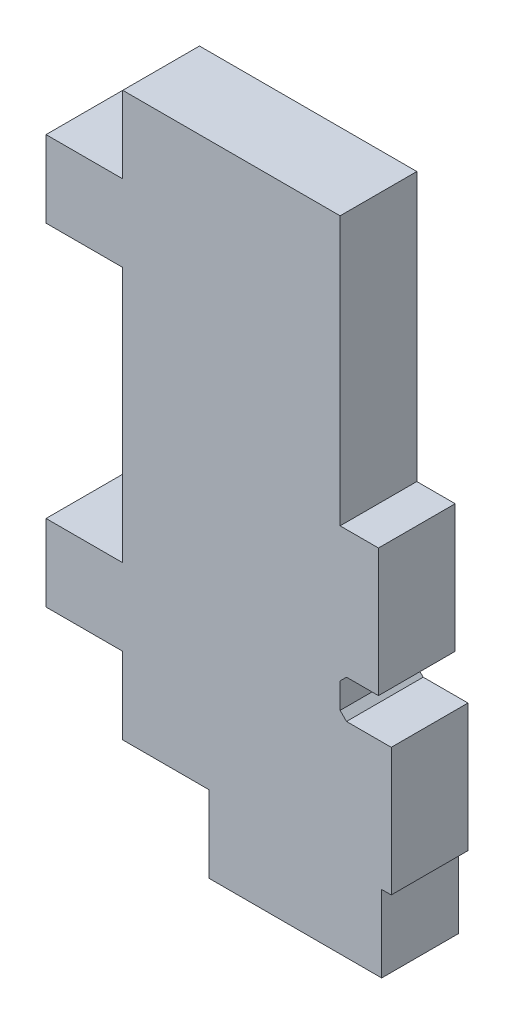
ISO-10303-21;
HEADER;
FILE_DESCRIPTION(('STEP AP214'),'2;1');
FILE_NAME('part.step','',(''),(''),'','','');
FILE_SCHEMA(('AUTOMOTIVE_DESIGN { 1 0 10303 214 1 1 1 1 }'));
ENDSEC;
DATA;
#1=APPLICATION_CONTEXT('core data for automotive mechanical design processes');
#2=APPLICATION_PROTOCOL_DEFINITION('international standard','automotive_design',2000,#1);
#3=PRODUCT_CONTEXT('',#1,'mechanical');
#4=PRODUCT('Part','Part','',(#3));
#5=PRODUCT_RELATED_PRODUCT_CATEGORY('part','',(#4));
#6=PRODUCT_DEFINITION_FORMATION('','',#4);
#7=PRODUCT_DEFINITION_CONTEXT('part definition',#1,'design');
#8=PRODUCT_DEFINITION('design','',#6,#7);
#9=PRODUCT_DEFINITION_SHAPE('','',#8);
#10=(LENGTH_UNIT() NAMED_UNIT(*) SI_UNIT(.MILLI.,.METRE.));
#11=(NAMED_UNIT(*) PLANE_ANGLE_UNIT() SI_UNIT($,.RADIAN.));
#12=(NAMED_UNIT(*) SI_UNIT($,.STERADIAN.) SOLID_ANGLE_UNIT());
#13=UNCERTAINTY_MEASURE_WITH_UNIT(LENGTH_MEASURE(1.E-05),#10,'distance_accuracy_value','');
#14=(GEOMETRIC_REPRESENTATION_CONTEXT(3) GLOBAL_UNCERTAINTY_ASSIGNED_CONTEXT((#13)) GLOBAL_UNIT_ASSIGNED_CONTEXT((#10,
#11,#12)) REPRESENTATION_CONTEXT('',''));
#15=CARTESIAN_POINT('',(0.,0.,0.));
#16=DIRECTION('',(0.,0.,1.));
#17=DIRECTION('',(1.,0.,0.));
#18=AXIS2_PLACEMENT_3D('',#15,#16,#17);
#19=CARTESIAN_POINT('',(0.,0.,3.));
#20=DIRECTION('',(0.,0.,1.));
#21=DIRECTION('',(1.,0.,0.));
#22=AXIS2_PLACEMENT_3D('',#19,#20,#21);
#23=PLANE('',#22);
#24=DIRECTION('',(-1.,0.,0.));
#25=VECTOR('',#24,1.);
#26=CARTESIAN_POINT('',(6.75,-4.5,3.));
#27=LINE('',#26,#25);
#28=CARTESIAN_POINT('',(6.25,-4.5,3.));
#29=VERTEX_POINT('',#28);
#30=CARTESIAN_POINT('',(5.,-4.5,3.));
#31=VERTEX_POINT('',#30);
#32=EDGE_CURVE('E204',#29,#31,#27,.T.);
#33=ORIENTED_EDGE('',*,*,#32,.F.);
#34=DIRECTION('',(0.,-1.,0.));
#35=VECTOR('',#34,1.);
#36=CARTESIAN_POINT('',(6.25,0.500000000000002,3.));
#37=LINE('',#36,#35);
#38=CARTESIAN_POINT('',(6.25,0.500000000000002,3.));
#39=VERTEX_POINT('',#38);
#40=EDGE_CURVE('E191',#39,#29,#37,.T.);
#41=ORIENTED_EDGE('',*,*,#40,.F.);
#42=DIRECTION('',(1.,0.,0.));
#43=VECTOR('',#42,1.);
#44=CARTESIAN_POINT('',(6.75,0.500000000000002,3.));
#45=LINE('',#44,#43);
#46=CARTESIAN_POINT('',(4.75,0.500000000000001,3.));
#47=VERTEX_POINT('',#46);
#48=EDGE_CURVE('E445',#47,#39,#45,.T.);
#49=ORIENTED_EDGE('',*,*,#48,.F.);
#50=DIRECTION('',(0.,-1.,0.));
#51=VECTOR('',#50,1.);
#52=CARTESIAN_POINT('',(4.75,11.,3.));
#53=LINE('',#52,#51);
#54=CARTESIAN_POINT('',(4.75,11.,3.));
#55=VERTEX_POINT('',#54);
#56=EDGE_CURVE('E434',#55,#47,#53,.T.);
#57=ORIENTED_EDGE('',*,*,#56,.F.);
#58=DIRECTION('',(-1.,0.,0.));
#59=VECTOR('',#58,1.);
#60=CARTESIAN_POINT('',(-3.75,11.,3.));
#61=LINE('',#60,#59);
#62=CARTESIAN_POINT('',(-3.75,11.,3.));
#63=VERTEX_POINT('',#62);
#64=EDGE_CURVE('E310',#55,#63,#61,.T.);
#65=ORIENTED_EDGE('',*,*,#64,.T.);
#66=DIRECTION('',(0.,-1.,0.));
#67=VECTOR('',#66,1.);
#68=CARTESIAN_POINT('',(-3.75,11.,3.));
#69=LINE('',#68,#67);
#70=CARTESIAN_POINT('',(-3.75,8.,3.));
#71=VERTEX_POINT('',#70);
#72=EDGE_CURVE('E314',#63,#71,#69,.T.);
#73=ORIENTED_EDGE('',*,*,#72,.T.);
#74=DIRECTION('',(1.,0.,0.));
#75=VECTOR('',#74,1.);
#76=CARTESIAN_POINT('',(-6.75,8.,3.));
#77=LINE('',#76,#75);
#78=CARTESIAN_POINT('',(-6.75,8.,3.));
#79=VERTEX_POINT('',#78);
#80=EDGE_CURVE('E243',#79,#71,#77,.T.);
#81=ORIENTED_EDGE('',*,*,#80,.F.);
#82=DIRECTION('',(0.,1.,0.));
#83=VECTOR('',#82,1.);
#84=CARTESIAN_POINT('',(-6.75,8.,3.));
#85=LINE('',#84,#83);
#86=CARTESIAN_POINT('',(-6.75,5.,3.));
#87=VERTEX_POINT('',#86);
#88=EDGE_CURVE('E232',#87,#79,#85,.T.);
#89=ORIENTED_EDGE('',*,*,#88,.F.);
#90=DIRECTION('',(1.,0.,0.));
#91=VECTOR('',#90,1.);
#92=CARTESIAN_POINT('',(-6.75,5.,3.));
#93=LINE('',#92,#91);
#94=CARTESIAN_POINT('',(-3.75,5.,3.));
#95=VERTEX_POINT('',#94);
#96=EDGE_CURVE('E246',#87,#95,#93,.T.);
#97=ORIENTED_EDGE('',*,*,#96,.T.);
#98=CARTESIAN_POINT('',(-3.75,-5.,3.));
#99=VERTEX_POINT('',#98);
#100=EDGE_CURVE('E318',#95,#99,#69,.T.);
#101=ORIENTED_EDGE('',*,*,#100,.T.);
#102=DIRECTION('',(1.,0.,0.));
#103=VECTOR('',#102,1.);
#104=CARTESIAN_POINT('',(-6.75,-5.,3.));
#105=LINE('',#104,#103);
#106=CARTESIAN_POINT('',(-6.75,-5.,3.));
#107=VERTEX_POINT('',#106);
#108=EDGE_CURVE('E270',#107,#99,#105,.T.);
#109=ORIENTED_EDGE('',*,*,#108,.F.);
#110=DIRECTION('',(0.,1.,0.));
#111=VECTOR('',#110,1.);
#112=CARTESIAN_POINT('',(-6.75,-8.,3.));
#113=LINE('',#112,#111);
#114=CARTESIAN_POINT('',(-6.75,-8.,3.));
#115=VERTEX_POINT('',#114);
#116=EDGE_CURVE('E259',#115,#107,#113,.T.);
#117=ORIENTED_EDGE('',*,*,#116,.F.);
#118=DIRECTION('',(1.,0.,0.));
#119=VECTOR('',#118,1.);
#120=CARTESIAN_POINT('',(-6.75,-8.,3.));
#121=LINE('',#120,#119);
#122=CARTESIAN_POINT('',(-3.75,-8.,3.));
#123=VERTEX_POINT('',#122);
#124=EDGE_CURVE('E273',#115,#123,#121,.T.);
#125=ORIENTED_EDGE('',*,*,#124,.T.);
#126=CARTESIAN_POINT('',(-3.75,-11.,3.));
#127=VERTEX_POINT('',#126);
#128=EDGE_CURVE('E313',#123,#127,#69,.T.);
#129=ORIENTED_EDGE('',*,*,#128,.T.);
#130=DIRECTION('',(1.,0.,0.));
#131=VECTOR('',#130,1.);
#132=CARTESIAN_POINT('',(-3.75,-11.,3.));
#133=LINE('',#132,#131);
#134=CARTESIAN_POINT('',(-0.375000000000001,-11.,3.));
#135=VERTEX_POINT('',#134);
#136=EDGE_CURVE('E319',#127,#135,#133,.T.);
#137=ORIENTED_EDGE('',*,*,#136,.T.);
#138=DIRECTION('',(0.,1.,0.));
#139=VECTOR('',#138,1.);
#140=CARTESIAN_POINT('',(-0.375000000000002,-14.,3.));
#141=LINE('',#140,#139);
#142=CARTESIAN_POINT('',(-0.375000000000002,-14.,3.));
#143=VERTEX_POINT('',#142);
#144=EDGE_CURVE('E290',#143,#135,#141,.T.);
#145=ORIENTED_EDGE('',*,*,#144,.F.);
#146=DIRECTION('',(-1.,0.,0.));
#147=VECTOR('',#146,1.);
#148=CARTESIAN_POINT('',(-0.375000000000002,-14.,3.));
#149=LINE('',#148,#147);
#150=CARTESIAN_POINT('',(6.375,-14.,3.));
#151=VERTEX_POINT('',#150);
#152=EDGE_CURVE('E288',#151,#143,#149,.T.);
#153=ORIENTED_EDGE('',*,*,#152,.F.);
#154=DIRECTION('',(0.,1.,0.));
#155=VECTOR('',#154,1.);
#156=CARTESIAN_POINT('',(6.375,-14.,3.));
#157=LINE('',#156,#155);
#158=CARTESIAN_POINT('',(6.375,-11.,3.));
#159=VERTEX_POINT('',#158);
#160=EDGE_CURVE('E297',#151,#159,#157,.T.);
#161=ORIENTED_EDGE('',*,*,#160,.T.);
#162=CARTESIAN_POINT('',(6.75,-11.,3.));
#163=VERTEX_POINT('',#162);
#164=EDGE_CURVE('E317',#159,#163,#133,.T.);
#165=ORIENTED_EDGE('',*,*,#164,.T.);
#166=DIRECTION('',(0.,1.,0.));
#167=VECTOR('',#166,1.);
#168=CARTESIAN_POINT('',(6.75,11.,3.));
#169=LINE('',#168,#167);
#170=CARTESIAN_POINT('',(6.75,-6.,3.));
#171=VERTEX_POINT('',#170);
#172=EDGE_CURVE('E307',#163,#171,#169,.T.);
#173=ORIENTED_EDGE('',*,*,#172,.T.);
#174=DIRECTION('',(1.,0.,0.));
#175=VECTOR('',#174,1.);
#176=CARTESIAN_POINT('',(6.75,-6.,3.));
#177=LINE('',#176,#175);
#178=CARTESIAN_POINT('',(5.,-6.,3.));
#179=VERTEX_POINT('',#178);
#180=EDGE_CURVE('E213',#179,#171,#177,.T.);
#181=ORIENTED_EDGE('',*,*,#180,.F.);
#182=DIRECTION('',(0.707106781186548,-0.707106781186548,0.));
#183=VECTOR('',#182,1.);
#184=CARTESIAN_POINT('',(5.,-6.,3.));
#185=LINE('',#184,#183);
#186=CARTESIAN_POINT('',(4.75,-5.75,3.));
#187=VERTEX_POINT('',#186);
#188=EDGE_CURVE('E41',#179,#187,#185,.F.);
#189=ORIENTED_EDGE('',*,*,#188,.T.);
#190=DIRECTION('',(0.,-1.,0.));
#191=VECTOR('',#190,1.);
#192=CARTESIAN_POINT('',(4.75,-4.5,3.));
#193=LINE('',#192,#191);
#194=CARTESIAN_POINT('',(4.75,-4.75,3.));
#195=VERTEX_POINT('',#194);
#196=EDGE_CURVE('E210',#195,#187,#193,.T.);
#197=ORIENTED_EDGE('',*,*,#196,.F.);
#198=DIRECTION('',(-0.707106781186548,-0.707106781186548,0.));
#199=VECTOR('',#198,1.);
#200=CARTESIAN_POINT('',(4.75,-4.75,3.));
#201=LINE('',#200,#199);
#202=EDGE_CURVE('E208',#195,#31,#201,.F.);
#203=ORIENTED_EDGE('',*,*,#202,.T.);
#204=EDGE_LOOP('',(#33,#41,#49,#57,#65,#73,#81,#89,#97,#101,#109,#117,#125,#129,#137,#145,#153,
#161,#165,#173,#181,#189,#197,#203));
#205=FACE_BOUND('',#204,.T.);
#206=ADVANCED_FACE('F33',(#205),#23,.T.);
#207=CARTESIAN_POINT('',(0.,0.,0.));
#208=DIRECTION('',(0.,0.,1.));
#209=DIRECTION('',(1.,0.,0.));
#210=AXIS2_PLACEMENT_3D('',#207,#208,#209);
#211=PLANE('',#210);
#212=DIRECTION('',(0.,1.,0.));
#213=VECTOR('',#212,1.);
#214=CARTESIAN_POINT('',(6.25,0.500000000000002,0.));
#215=LINE('',#214,#213);
#216=CARTESIAN_POINT('',(6.25,-4.5,0.));
#217=VERTEX_POINT('',#216);
#218=CARTESIAN_POINT('',(6.25,0.500000000000002,0.));
#219=VERTEX_POINT('',#218);
#220=EDGE_CURVE('E48',#217,#219,#215,.T.);
#221=ORIENTED_EDGE('',*,*,#220,.F.);
#222=DIRECTION('',(-1.,0.,0.));
#223=VECTOR('',#222,1.);
#224=CARTESIAN_POINT('',(6.75,-4.5,0.));
#225=LINE('',#224,#223);
#226=CARTESIAN_POINT('',(5.,-4.5,0.));
#227=VERTEX_POINT('',#226);
#228=EDGE_CURVE('E206',#217,#227,#225,.T.);
#229=ORIENTED_EDGE('',*,*,#228,.T.);
#230=DIRECTION('',(0.707106781186548,0.707106781186548,0.));
#231=VECTOR('',#230,1.);
#232=CARTESIAN_POINT('',(4.75,-4.75,0.));
#233=LINE('',#232,#231);
#234=CARTESIAN_POINT('',(4.75,-4.75,0.));
#235=VERTEX_POINT('',#234);
#236=EDGE_CURVE('E347',#227,#235,#233,.F.);
#237=ORIENTED_EDGE('',*,*,#236,.T.);
#238=DIRECTION('',(0.,-1.,0.));
#239=VECTOR('',#238,1.);
#240=CARTESIAN_POINT('',(4.75,-4.5,0.));
#241=LINE('',#240,#239);
#242=CARTESIAN_POINT('',(4.75,-5.75,0.));
#243=VERTEX_POINT('',#242);
#244=EDGE_CURVE('E358',#235,#243,#241,.T.);
#245=ORIENTED_EDGE('',*,*,#244,.T.);
#246=DIRECTION('',(-0.707106781186548,0.707106781186548,0.));
#247=VECTOR('',#246,1.);
#248=CARTESIAN_POINT('',(-0.499999999999999,-0.499999999999999,0.));
#249=LINE('',#248,#247);
#250=CARTESIAN_POINT('',(5.,-6.,0.));
#251=VERTEX_POINT('',#250);
#252=EDGE_CURVE('E11',#243,#251,#249,.F.);
#253=ORIENTED_EDGE('',*,*,#252,.T.);
#254=DIRECTION('',(1.,0.,0.));
#255=VECTOR('',#254,1.);
#256=CARTESIAN_POINT('',(6.75,-6.,0.));
#257=LINE('',#256,#255);
#258=CARTESIAN_POINT('',(6.75,-6.,0.));
#259=VERTEX_POINT('',#258);
#260=EDGE_CURVE('E218',#251,#259,#257,.T.);
#261=ORIENTED_EDGE('',*,*,#260,.T.);
#262=DIRECTION('',(0.,1.,0.));
#263=VECTOR('',#262,1.);
#264=CARTESIAN_POINT('',(6.75,11.,0.));
#265=LINE('',#264,#263);
#266=CARTESIAN_POINT('',(6.75,-11.,0.));
#267=VERTEX_POINT('',#266);
#268=EDGE_CURVE('E306',#267,#259,#265,.T.);
#269=ORIENTED_EDGE('',*,*,#268,.F.);
#270=DIRECTION('',(1.,0.,0.));
#271=VECTOR('',#270,1.);
#272=CARTESIAN_POINT('',(-3.75,-11.,0.));
#273=LINE('',#272,#271);
#274=CARTESIAN_POINT('',(6.375,-11.,0.));
#275=VERTEX_POINT('',#274);
#276=EDGE_CURVE('E330',#275,#267,#273,.T.);
#277=ORIENTED_EDGE('',*,*,#276,.F.);
#278=DIRECTION('',(0.,1.,0.));
#279=VECTOR('',#278,1.);
#280=CARTESIAN_POINT('',(6.375,-14.,0.));
#281=LINE('',#280,#279);
#282=CARTESIAN_POINT('',(6.375,-14.,0.));
#283=VERTEX_POINT('',#282);
#284=EDGE_CURVE('E300',#283,#275,#281,.T.);
#285=ORIENTED_EDGE('',*,*,#284,.F.);
#286=DIRECTION('',(1.,0.,0.));
#287=VECTOR('',#286,1.);
#288=CARTESIAN_POINT('',(-0.375000000000001,-14.,0.));
#289=LINE('',#288,#287);
#290=CARTESIAN_POINT('',(-0.375000000000001,-14.,0.));
#291=VERTEX_POINT('',#290);
#292=EDGE_CURVE('E283',#291,#283,#289,.T.);
#293=ORIENTED_EDGE('',*,*,#292,.F.);
#294=DIRECTION('',(0.,1.,0.));
#295=VECTOR('',#294,1.);
#296=CARTESIAN_POINT('',(-0.375000000000001,-14.,0.));
#297=LINE('',#296,#295);
#298=CARTESIAN_POINT('',(-0.375000000000001,-11.,0.));
#299=VERTEX_POINT('',#298);
#300=EDGE_CURVE('E303',#291,#299,#297,.T.);
#301=ORIENTED_EDGE('',*,*,#300,.T.);
#302=CARTESIAN_POINT('',(-3.75,-11.,0.));
#303=VERTEX_POINT('',#302);
#304=EDGE_CURVE('E311',#303,#299,#273,.T.);
#305=ORIENTED_EDGE('',*,*,#304,.F.);
#306=DIRECTION('',(0.,-1.,0.));
#307=VECTOR('',#306,1.);
#308=CARTESIAN_POINT('',(-3.75,11.,0.));
#309=LINE('',#308,#307);
#310=CARTESIAN_POINT('',(-3.75,-7.99999999999999,0.));
#311=VERTEX_POINT('',#310);
#312=EDGE_CURVE('E327',#311,#303,#309,.T.);
#313=ORIENTED_EDGE('',*,*,#312,.F.);
#314=DIRECTION('',(1.,0.,0.));
#315=VECTOR('',#314,1.);
#316=CARTESIAN_POINT('',(-6.75,-7.99999999999999,0.));
#317=LINE('',#316,#315);
#318=CARTESIAN_POINT('',(-6.75,-7.99999999999999,0.));
#319=VERTEX_POINT('',#318);
#320=EDGE_CURVE('E276',#319,#311,#317,.T.);
#321=ORIENTED_EDGE('',*,*,#320,.F.);
#322=DIRECTION('',(0.,-1.,0.));
#323=VECTOR('',#322,1.);
#324=CARTESIAN_POINT('',(-6.75,-7.99999999999999,0.));
#325=LINE('',#324,#323);
#326=CARTESIAN_POINT('',(-6.75,-5.,0.));
#327=VERTEX_POINT('',#326);
#328=EDGE_CURVE('E253',#327,#319,#325,.T.);
#329=ORIENTED_EDGE('',*,*,#328,.F.);
#330=DIRECTION('',(1.,0.,0.));
#331=VECTOR('',#330,1.);
#332=CARTESIAN_POINT('',(-6.75,-5.,0.));
#333=LINE('',#332,#331);
#334=CARTESIAN_POINT('',(-3.75,-5.,0.));
#335=VERTEX_POINT('',#334);
#336=EDGE_CURVE('E263',#327,#335,#333,.T.);
#337=ORIENTED_EDGE('',*,*,#336,.T.);
#338=CARTESIAN_POINT('',(-3.75,5.,0.));
#339=VERTEX_POINT('',#338);
#340=EDGE_CURVE('E331',#339,#335,#309,.T.);
#341=ORIENTED_EDGE('',*,*,#340,.F.);
#342=DIRECTION('',(1.,0.,0.));
#343=VECTOR('',#342,1.);
#344=CARTESIAN_POINT('',(-6.75,5.,0.));
#345=LINE('',#344,#343);
#346=CARTESIAN_POINT('',(-6.75,5.,0.));
#347=VERTEX_POINT('',#346);
#348=EDGE_CURVE('E249',#347,#339,#345,.T.);
#349=ORIENTED_EDGE('',*,*,#348,.F.);
#350=DIRECTION('',(0.,-1.,0.));
#351=VECTOR('',#350,1.);
#352=CARTESIAN_POINT('',(-6.75,8.,0.));
#353=LINE('',#352,#351);
#354=CARTESIAN_POINT('',(-6.75,8.,0.));
#355=VERTEX_POINT('',#354);
#356=EDGE_CURVE('E226',#355,#347,#353,.T.);
#357=ORIENTED_EDGE('',*,*,#356,.F.);
#358=DIRECTION('',(1.,0.,0.));
#359=VECTOR('',#358,1.);
#360=CARTESIAN_POINT('',(-6.75,8.,0.));
#361=LINE('',#360,#359);
#362=CARTESIAN_POINT('',(-3.75,8.,0.));
#363=VERTEX_POINT('',#362);
#364=EDGE_CURVE('E236',#355,#363,#361,.T.);
#365=ORIENTED_EDGE('',*,*,#364,.T.);
#366=CARTESIAN_POINT('',(-3.75,11.,0.));
#367=VERTEX_POINT('',#366);
#368=EDGE_CURVE('E328',#367,#363,#309,.T.);
#369=ORIENTED_EDGE('',*,*,#368,.F.);
#370=DIRECTION('',(-1.,0.,0.));
#371=VECTOR('',#370,1.);
#372=CARTESIAN_POINT('',(-3.75,11.,0.));
#373=LINE('',#372,#371);
#374=CARTESIAN_POINT('',(4.75,11.,0.));
#375=VERTEX_POINT('',#374);
#376=EDGE_CURVE('E325',#375,#367,#373,.T.);
#377=ORIENTED_EDGE('',*,*,#376,.F.);
#378=DIRECTION('',(0.,-1.,0.));
#379=VECTOR('',#378,1.);
#380=CARTESIAN_POINT('',(4.75,11.,0.));
#381=LINE('',#380,#379);
#382=CARTESIAN_POINT('',(4.75,0.500000000000001,0.));
#383=VERTEX_POINT('',#382);
#384=EDGE_CURVE('E441',#375,#383,#381,.T.);
#385=ORIENTED_EDGE('',*,*,#384,.T.);
#386=DIRECTION('',(1.,0.,0.));
#387=VECTOR('',#386,1.);
#388=CARTESIAN_POINT('',(6.75,0.500000000000002,0.));
#389=LINE('',#388,#387);
#390=EDGE_CURVE('E442',#383,#219,#389,.T.);
#391=ORIENTED_EDGE('',*,*,#390,.T.);
#392=EDGE_LOOP('',(#221,#229,#237,#245,#253,#261,#269,#277,#285,#293,#301,#305,#313,#321,#329,
#337,#341,#349,#357,#365,#369,#377,#385,#391));
#393=FACE_BOUND('',#392,.T.);
#394=ADVANCED_FACE('F363',(#393),#211,.F.);
#395=CARTESIAN_POINT('',(6.75,-4.5,0.));
#396=DIRECTION('',(0.,1.,0.));
#397=DIRECTION('',(0.,0.,1.));
#398=AXIS2_PLACEMENT_3D('',#395,#396,#397);
#399=PLANE('',#398);
#400=DIRECTION('',(0.,0.,-1.));
#401=VECTOR('',#400,1.);
#402=CARTESIAN_POINT('',(6.25,-4.5,3.));
#403=LINE('',#402,#401);
#404=EDGE_CURVE('E194',#29,#217,#403,.T.);
#405=ORIENTED_EDGE('',*,*,#404,.F.);
#406=ORIENTED_EDGE('',*,*,#32,.T.);
#407=DIRECTION('',(0.,0.,-1.));
#408=VECTOR('',#407,1.);
#409=CARTESIAN_POINT('',(5.,-4.5,0.));
#410=LINE('',#409,#408);
#411=EDGE_CURVE('E344',#31,#227,#410,.T.);
#412=ORIENTED_EDGE('',*,*,#411,.T.);
#413=ORIENTED_EDGE('',*,*,#228,.F.);
#414=EDGE_LOOP('',(#405,#406,#412,#413));
#415=FACE_BOUND('',#414,.T.);
#416=ADVANCED_FACE('F202',(#415),#399,.F.);
#417=CARTESIAN_POINT('',(6.75,0.500000000000002,0.));
#418=DIRECTION('',(0.,-1.,0.));
#419=DIRECTION('',(1.,0.,0.));
#420=AXIS2_PLACEMENT_3D('',#417,#418,#419);
#421=PLANE('',#420);
#422=DIRECTION('',(0.,0.,1.));
#423=VECTOR('',#422,1.);
#424=CARTESIAN_POINT('',(6.25,0.500000000000002,3.));
#425=LINE('',#424,#423);
#426=EDGE_CURVE('E195',#219,#39,#425,.T.);
#427=ORIENTED_EDGE('',*,*,#426,.F.);
#428=ORIENTED_EDGE('',*,*,#390,.F.);
#429=DIRECTION('',(0.,0.,1.));
#430=VECTOR('',#429,1.);
#431=CARTESIAN_POINT('',(4.75,0.500000000000001,0.));
#432=LINE('',#431,#430);
#433=EDGE_CURVE('E211',#383,#47,#432,.T.);
#434=ORIENTED_EDGE('',*,*,#433,.T.);
#435=ORIENTED_EDGE('',*,*,#48,.T.);
#436=EDGE_LOOP('',(#427,#428,#434,#435));
#437=FACE_BOUND('',#436,.T.);
#438=ADVANCED_FACE('F482',(#437),#421,.F.);
#439=CARTESIAN_POINT('',(6.75,11.,3.));
#440=DIRECTION('',(-1.,0.,0.));
#441=DIRECTION('',(0.,-1.,0.));
#442=AXIS2_PLACEMENT_3D('',#439,#440,#441);
#443=PLANE('',#442);
#444=ORIENTED_EDGE('',*,*,#268,.T.);
#445=DIRECTION('',(0.,0.,1.));
#446=VECTOR('',#445,1.);
#447=CARTESIAN_POINT('',(6.75,-6.,0.));
#448=LINE('',#447,#446);
#449=EDGE_CURVE('E222',#259,#171,#448,.T.);
#450=ORIENTED_EDGE('',*,*,#449,.T.);
#451=ORIENTED_EDGE('',*,*,#172,.F.);
#452=DIRECTION('',(0.,0.,-1.));
#453=VECTOR('',#452,1.);
#454=CARTESIAN_POINT('',(6.75,-11.,3.));
#455=LINE('',#454,#453);
#456=EDGE_CURVE('E322',#163,#267,#455,.T.);
#457=ORIENTED_EDGE('',*,*,#456,.T.);
#458=EDGE_LOOP('',(#444,#450,#451,#457));
#459=FACE_BOUND('',#458,.T.);
#460=ADVANCED_FACE('F373',(#459),#443,.F.);
#461=CARTESIAN_POINT('',(-3.75,11.,3.));
#462=DIRECTION('',(1.,0.,0.));
#463=DIRECTION('',(0.,1.,0.));
#464=AXIS2_PLACEMENT_3D('',#461,#462,#463);
#465=PLANE('',#464);
#466=DIRECTION('',(0.,0.,1.));
#467=VECTOR('',#466,1.);
#468=CARTESIAN_POINT('',(-3.75,5.,0.));
#469=LINE('',#468,#467);
#470=EDGE_CURVE('E225',#339,#95,#469,.T.);
#471=ORIENTED_EDGE('',*,*,#470,.F.);
#472=ORIENTED_EDGE('',*,*,#340,.T.);
#473=DIRECTION('',(0.,0.,-1.));
#474=VECTOR('',#473,1.);
#475=CARTESIAN_POINT('',(-3.75,-5.,0.));
#476=LINE('',#475,#474);
#477=EDGE_CURVE('E257',#99,#335,#476,.T.);
#478=ORIENTED_EDGE('',*,*,#477,.F.);
#479=ORIENTED_EDGE('',*,*,#100,.F.);
#480=EDGE_LOOP('',(#471,#472,#478,#479));
#481=FACE_BOUND('',#480,.T.);
#482=ADVANCED_FACE('F404',(#481),#465,.F.);
#483=DIRECTION('',(0.,0.,-1.));
#484=VECTOR('',#483,1.);
#485=CARTESIAN_POINT('',(-3.75,8.,0.));
#486=LINE('',#485,#484);
#487=EDGE_CURVE('E230',#71,#363,#486,.T.);
#488=ORIENTED_EDGE('',*,*,#487,.F.);
#489=ORIENTED_EDGE('',*,*,#72,.F.);
#490=DIRECTION('',(0.,0.,-1.));
#491=VECTOR('',#490,1.);
#492=CARTESIAN_POINT('',(-3.75,11.,3.));
#493=LINE('',#492,#491);
#494=EDGE_CURVE('E338',#63,#367,#493,.T.);
#495=ORIENTED_EDGE('',*,*,#494,.T.);
#496=ORIENTED_EDGE('',*,*,#368,.T.);
#497=EDGE_LOOP('',(#488,#489,#495,#496));
#498=FACE_BOUND('',#497,.T.);
#499=ADVANCED_FACE('F429',(#498),#465,.F.);
#500=DIRECTION('',(0.,0.,1.));
#501=VECTOR('',#500,1.);
#502=CARTESIAN_POINT('',(-3.75,-7.99999999999999,0.));
#503=LINE('',#502,#501);
#504=EDGE_CURVE('E252',#311,#123,#503,.T.);
#505=ORIENTED_EDGE('',*,*,#504,.F.);
#506=ORIENTED_EDGE('',*,*,#312,.T.);
#507=DIRECTION('',(0.,0.,-1.));
#508=VECTOR('',#507,1.);
#509=CARTESIAN_POINT('',(-3.75,-11.,3.));
#510=LINE('',#509,#508);
#511=EDGE_CURVE('E335',#127,#303,#510,.T.);
#512=ORIENTED_EDGE('',*,*,#511,.F.);
#513=ORIENTED_EDGE('',*,*,#128,.F.);
#514=EDGE_LOOP('',(#505,#506,#512,#513));
#515=FACE_BOUND('',#514,.T.);
#516=ADVANCED_FACE('F399',(#515),#465,.F.);
#517=CARTESIAN_POINT('',(-3.75,-11.,3.));
#518=DIRECTION('',(0.,1.,0.));
#519=DIRECTION('',(0.,0.,1.));
#520=AXIS2_PLACEMENT_3D('',#517,#518,#519);
#521=PLANE('',#520);
#522=DIRECTION('',(0.,0.,-1.));
#523=VECTOR('',#522,1.);
#524=CARTESIAN_POINT('',(-0.375000000000002,-11.,3.));
#525=LINE('',#524,#523);
#526=EDGE_CURVE('E279',#135,#299,#525,.T.);
#527=ORIENTED_EDGE('',*,*,#526,.F.);
#528=ORIENTED_EDGE('',*,*,#136,.F.);
#529=ORIENTED_EDGE('',*,*,#511,.T.);
#530=ORIENTED_EDGE('',*,*,#304,.T.);
#531=EDGE_LOOP('',(#527,#528,#529,#530));
#532=FACE_BOUND('',#531,.T.);
#533=ADVANCED_FACE('F394',(#532),#521,.F.);
#534=DIRECTION('',(0.,0.,1.));
#535=VECTOR('',#534,1.);
#536=CARTESIAN_POINT('',(6.375,-11.,3.));
#537=LINE('',#536,#535);
#538=EDGE_CURVE('E284',#275,#159,#537,.T.);
#539=ORIENTED_EDGE('',*,*,#538,.F.);
#540=ORIENTED_EDGE('',*,*,#276,.T.);
#541=ORIENTED_EDGE('',*,*,#456,.F.);
#542=ORIENTED_EDGE('',*,*,#164,.F.);
#543=EDGE_LOOP('',(#539,#540,#541,#542));
#544=FACE_BOUND('',#543,.T.);
#545=ADVANCED_FACE('F477',(#544),#521,.F.);
#546=CARTESIAN_POINT('',(-3.75,11.,3.));
#547=DIRECTION('',(0.,-1.,0.));
#548=DIRECTION('',(0.,0.,-1.));
#549=AXIS2_PLACEMENT_3D('',#546,#547,#548);
#550=PLANE('',#549);
#551=ORIENTED_EDGE('',*,*,#64,.F.);
#552=DIRECTION('',(0.,0.,1.));
#553=VECTOR('',#552,1.);
#554=CARTESIAN_POINT('',(4.75,11.,0.));
#555=LINE('',#554,#553);
#556=EDGE_CURVE('E215',#375,#55,#555,.T.);
#557=ORIENTED_EDGE('',*,*,#556,.F.);
#558=ORIENTED_EDGE('',*,*,#376,.T.);
#559=ORIENTED_EDGE('',*,*,#494,.F.);
#560=EDGE_LOOP('',(#551,#557,#558,#559));
#561=FACE_BOUND('',#560,.T.);
#562=ADVANCED_FACE('F437',(#561),#550,.F.);
#563=CARTESIAN_POINT('',(-0.375000000000002,-14.,3.));
#564=DIRECTION('',(1.,0.,0.));
#565=DIRECTION('',(0.,0.,-1.));
#566=AXIS2_PLACEMENT_3D('',#563,#564,#565);
#567=PLANE('',#566);
#568=ORIENTED_EDGE('',*,*,#526,.T.);
#569=ORIENTED_EDGE('',*,*,#300,.F.);
#570=DIRECTION('',(0.,0.,-1.));
#571=VECTOR('',#570,1.);
#572=CARTESIAN_POINT('',(-0.375000000000002,-14.,3.));
#573=LINE('',#572,#571);
#574=EDGE_CURVE('E280',#143,#291,#573,.T.);
#575=ORIENTED_EDGE('',*,*,#574,.F.);
#576=ORIENTED_EDGE('',*,*,#144,.T.);
#577=EDGE_LOOP('',(#568,#569,#575,#576));
#578=FACE_BOUND('',#577,.T.);
#579=ADVANCED_FACE('F391',(#578),#567,.F.);
#580=CARTESIAN_POINT('',(6.375,-14.,3.));
#581=DIRECTION('',(-1.,0.,0.));
#582=DIRECTION('',(0.,0.,1.));
#583=AXIS2_PLACEMENT_3D('',#580,#581,#582);
#584=PLANE('',#583);
#585=ORIENTED_EDGE('',*,*,#538,.T.);
#586=ORIENTED_EDGE('',*,*,#160,.F.);
#587=DIRECTION('',(0.,0.,1.));
#588=VECTOR('',#587,1.);
#589=CARTESIAN_POINT('',(6.375,-14.,3.));
#590=LINE('',#589,#588);
#591=EDGE_CURVE('E286',#283,#151,#590,.T.);
#592=ORIENTED_EDGE('',*,*,#591,.F.);
#593=ORIENTED_EDGE('',*,*,#284,.T.);
#594=EDGE_LOOP('',(#585,#586,#592,#593));
#595=FACE_BOUND('',#594,.T.);
#596=ADVANCED_FACE('F380',(#595),#584,.F.);
#597=CARTESIAN_POINT('',(0.,-14.,0.));
#598=DIRECTION('',(0.,-1.,0.));
#599=DIRECTION('',(0.,0.,-1.));
#600=AXIS2_PLACEMENT_3D('',#597,#598,#599);
#601=PLANE('',#600);
#602=ORIENTED_EDGE('',*,*,#574,.T.);
#603=ORIENTED_EDGE('',*,*,#292,.T.);
#604=ORIENTED_EDGE('',*,*,#591,.T.);
#605=ORIENTED_EDGE('',*,*,#152,.T.);
#606=EDGE_LOOP('',(#602,#603,#604,#605));
#607=FACE_BOUND('',#606,.T.);
#608=ADVANCED_FACE('F384',(#607),#601,.T.);
#609=CARTESIAN_POINT('',(-6.75,-7.99999999999999,0.));
#610=DIRECTION('',(0.,1.,0.));
#611=DIRECTION('',(0.,0.,1.));
#612=AXIS2_PLACEMENT_3D('',#609,#610,#611);
#613=PLANE('',#612);
#614=ORIENTED_EDGE('',*,*,#504,.T.);
#615=ORIENTED_EDGE('',*,*,#124,.F.);
#616=DIRECTION('',(0.,0.,1.));
#617=VECTOR('',#616,1.);
#618=CARTESIAN_POINT('',(-6.75,-7.99999999999999,0.));
#619=LINE('',#618,#617);
#620=EDGE_CURVE('E256',#319,#115,#619,.T.);
#621=ORIENTED_EDGE('',*,*,#620,.F.);
#622=ORIENTED_EDGE('',*,*,#320,.T.);
#623=EDGE_LOOP('',(#614,#615,#621,#622));
#624=FACE_BOUND('',#623,.T.);
#625=ADVANCED_FACE('F509',(#624),#613,.F.);
#626=CARTESIAN_POINT('',(-6.75,-5.,0.));
#627=DIRECTION('',(0.,-1.,0.));
#628=DIRECTION('',(0.,0.,-1.));
#629=AXIS2_PLACEMENT_3D('',#626,#627,#628);
#630=PLANE('',#629);
#631=ORIENTED_EDGE('',*,*,#477,.T.);
#632=ORIENTED_EDGE('',*,*,#336,.F.);
#633=DIRECTION('',(0.,0.,-1.));
#634=VECTOR('',#633,1.);
#635=CARTESIAN_POINT('',(-6.75,-5.,0.));
#636=LINE('',#635,#634);
#637=EDGE_CURVE('E261',#107,#327,#636,.T.);
#638=ORIENTED_EDGE('',*,*,#637,.F.);
#639=ORIENTED_EDGE('',*,*,#108,.T.);
#640=EDGE_LOOP('',(#631,#632,#638,#639));
#641=FACE_BOUND('',#640,.T.);
#642=ADVANCED_FACE('F408',(#641),#630,.F.);
#643=CARTESIAN_POINT('',(-6.75,0.,0.));
#644=DIRECTION('',(1.,0.,0.));
#645=DIRECTION('',(0.,0.,-1.));
#646=AXIS2_PLACEMENT_3D('',#643,#644,#645);
#647=PLANE('',#646);
#648=ORIENTED_EDGE('',*,*,#328,.T.);
#649=ORIENTED_EDGE('',*,*,#620,.T.);
#650=ORIENTED_EDGE('',*,*,#116,.T.);
#651=ORIENTED_EDGE('',*,*,#637,.T.);
#652=EDGE_LOOP('',(#648,#649,#650,#651));
#653=FACE_BOUND('',#652,.T.);
#654=ADVANCED_FACE('F413',(#653),#647,.F.);
#655=CARTESIAN_POINT('',(-6.75,5.,0.));
#656=DIRECTION('',(0.,1.,0.));
#657=DIRECTION('',(-1.,0.,0.));
#658=AXIS2_PLACEMENT_3D('',#655,#656,#657);
#659=PLANE('',#658);
#660=ORIENTED_EDGE('',*,*,#470,.T.);
#661=ORIENTED_EDGE('',*,*,#96,.F.);
#662=DIRECTION('',(0.,0.,1.));
#663=VECTOR('',#662,1.);
#664=CARTESIAN_POINT('',(-6.75,5.,0.));
#665=LINE('',#664,#663);
#666=EDGE_CURVE('E229',#347,#87,#665,.T.);
#667=ORIENTED_EDGE('',*,*,#666,.F.);
#668=ORIENTED_EDGE('',*,*,#348,.T.);
#669=EDGE_LOOP('',(#660,#661,#667,#668));
#670=FACE_BOUND('',#669,.T.);
#671=ADVANCED_FACE('F417',(#670),#659,.F.);
#672=CARTESIAN_POINT('',(-6.75,8.,0.));
#673=DIRECTION('',(0.,-1.,0.));
#674=DIRECTION('',(1.,0.,0.));
#675=AXIS2_PLACEMENT_3D('',#672,#673,#674);
#676=PLANE('',#675);
#677=ORIENTED_EDGE('',*,*,#487,.T.);
#678=ORIENTED_EDGE('',*,*,#364,.F.);
#679=DIRECTION('',(0.,0.,-1.));
#680=VECTOR('',#679,1.);
#681=CARTESIAN_POINT('',(-6.75,8.,0.));
#682=LINE('',#681,#680);
#683=EDGE_CURVE('E234',#79,#355,#682,.T.);
#684=ORIENTED_EDGE('',*,*,#683,.F.);
#685=ORIENTED_EDGE('',*,*,#80,.T.);
#686=EDGE_LOOP('',(#677,#678,#684,#685));
#687=FACE_BOUND('',#686,.T.);
#688=ADVANCED_FACE('F426',(#687),#676,.F.);
#689=CARTESIAN_POINT('',(-6.75,0.,0.));
#690=DIRECTION('',(-1.,0.,0.));
#691=DIRECTION('',(0.,0.,1.));
#692=AXIS2_PLACEMENT_3D('',#689,#690,#691);
#693=PLANE('',#692);
#694=ORIENTED_EDGE('',*,*,#356,.T.);
#695=ORIENTED_EDGE('',*,*,#666,.T.);
#696=ORIENTED_EDGE('',*,*,#88,.T.);
#697=ORIENTED_EDGE('',*,*,#683,.T.);
#698=EDGE_LOOP('',(#694,#695,#696,#697));
#699=FACE_BOUND('',#698,.T.);
#700=ADVANCED_FACE('F422',(#699),#693,.T.);
#701=CARTESIAN_POINT('',(6.75,-6.,0.));
#702=DIRECTION('',(0.,-1.,0.));
#703=DIRECTION('',(1.,0.,0.));
#704=AXIS2_PLACEMENT_3D('',#701,#702,#703);
#705=PLANE('',#704);
#706=ORIENTED_EDGE('',*,*,#260,.F.);
#707=DIRECTION('',(0.,0.,1.));
#708=VECTOR('',#707,1.);
#709=CARTESIAN_POINT('',(5.,-6.,3.));
#710=LINE('',#709,#708);
#711=EDGE_CURVE('E349',#251,#179,#710,.T.);
#712=ORIENTED_EDGE('',*,*,#711,.T.);
#713=ORIENTED_EDGE('',*,*,#180,.T.);
#714=ORIENTED_EDGE('',*,*,#449,.F.);
#715=EDGE_LOOP('',(#706,#712,#713,#714));
#716=FACE_BOUND('',#715,.T.);
#717=ADVANCED_FACE('F368',(#716),#705,.F.);
#718=CARTESIAN_POINT('',(4.75,-4.5,0.));
#719=DIRECTION('',(-1.,0.,0.));
#720=DIRECTION('',(0.,0.,1.));
#721=AXIS2_PLACEMENT_3D('',#718,#719,#720);
#722=PLANE('',#721);
#723=ORIENTED_EDGE('',*,*,#196,.T.);
#724=DIRECTION('',(0.,0.,-1.));
#725=VECTOR('',#724,1.);
#726=CARTESIAN_POINT('',(4.75,-5.75,0.));
#727=LINE('',#726,#725);
#728=EDGE_CURVE('E352',#187,#243,#727,.T.);
#729=ORIENTED_EDGE('',*,*,#728,.T.);
#730=ORIENTED_EDGE('',*,*,#244,.F.);
#731=DIRECTION('',(0.,0.,1.));
#732=VECTOR('',#731,1.);
#733=CARTESIAN_POINT('',(4.75,-4.75,3.));
#734=LINE('',#733,#732);
#735=EDGE_CURVE('E341',#235,#195,#734,.T.);
#736=ORIENTED_EDGE('',*,*,#735,.T.);
#737=EDGE_LOOP('',(#723,#729,#730,#736));
#738=FACE_BOUND('',#737,.T.);
#739=ADVANCED_FACE('F357',(#738),#722,.F.);
#740=CARTESIAN_POINT('',(4.75,11.,0.));
#741=DIRECTION('',(-1.,0.,0.));
#742=DIRECTION('',(0.,0.,1.));
#743=AXIS2_PLACEMENT_3D('',#740,#741,#742);
#744=PLANE('',#743);
#745=ORIENTED_EDGE('',*,*,#56,.T.);
#746=ORIENTED_EDGE('',*,*,#433,.F.);
#747=ORIENTED_EDGE('',*,*,#384,.F.);
#748=ORIENTED_EDGE('',*,*,#556,.T.);
#749=EDGE_LOOP('',(#745,#746,#747,#748));
#750=FACE_BOUND('',#749,.T.);
#751=ADVANCED_FACE('F457',(#750),#744,.F.);
#752=CARTESIAN_POINT('',(4.75,-4.75,0.));
#753=DIRECTION('',(0.707106781186547,-0.707106781186547,0.));
#754=DIRECTION('',(0.,0.,-1.));
#755=AXIS2_PLACEMENT_3D('',#752,#753,#754);
#756=PLANE('',#755);
#757=ORIENTED_EDGE('',*,*,#236,.F.);
#758=ORIENTED_EDGE('',*,*,#411,.F.);
#759=ORIENTED_EDGE('',*,*,#202,.F.);
#760=ORIENTED_EDGE('',*,*,#735,.F.);
#761=EDGE_LOOP('',(#757,#758,#759,#760));
#762=FACE_BOUND('',#761,.T.);
#763=ADVANCED_FACE('F455',(#762),#756,.T.);
#764=CARTESIAN_POINT('',(5.,-6.,0.));
#765=DIRECTION('',(0.707106781186547,0.707106781186547,0.));
#766=DIRECTION('',(0.,0.,-1.));
#767=AXIS2_PLACEMENT_3D('',#764,#765,#766);
#768=PLANE('',#767);
#769=ORIENTED_EDGE('',*,*,#252,.F.);
#770=ORIENTED_EDGE('',*,*,#728,.F.);
#771=ORIENTED_EDGE('',*,*,#188,.F.);
#772=ORIENTED_EDGE('',*,*,#711,.F.);
#773=EDGE_LOOP('',(#769,#770,#771,#772));
#774=FACE_BOUND('',#773,.T.);
#775=ADVANCED_FACE('F35',(#774),#768,.T.);
#776=CARTESIAN_POINT('',(6.25,0.,0.));
#777=DIRECTION('',(1.,0.,0.));
#778=DIRECTION('',(0.,1.,0.));
#779=AXIS2_PLACEMENT_3D('',#776,#777,#778);
#780=PLANE('',#779);
#781=ORIENTED_EDGE('',*,*,#40,.T.);
#782=ORIENTED_EDGE('',*,*,#404,.T.);
#783=ORIENTED_EDGE('',*,*,#220,.T.);
#784=ORIENTED_EDGE('',*,*,#426,.T.);
#785=EDGE_LOOP('',(#781,#782,#783,#784));
#786=FACE_BOUND('',#785,.T.);
#787=ADVANCED_FACE('F193',(#786),#780,.T.);
#788=CLOSED_SHELL('',(#206,#394,#416,#438,#460,#482,#499,#516,#533,#545,#562,#579,#596,#608,
#625,#642,#654,#671,#688,#700,#717,#739,#751,#763,#775,#787));
#789=MANIFOLD_SOLID_BREP('B2',#788);
#790=ADVANCED_BREP_SHAPE_REPRESENTATION('',(#18,#789),#14);
#791=SHAPE_DEFINITION_REPRESENTATION(#9,#790);
ENDSEC;
END-ISO-10303-21;
